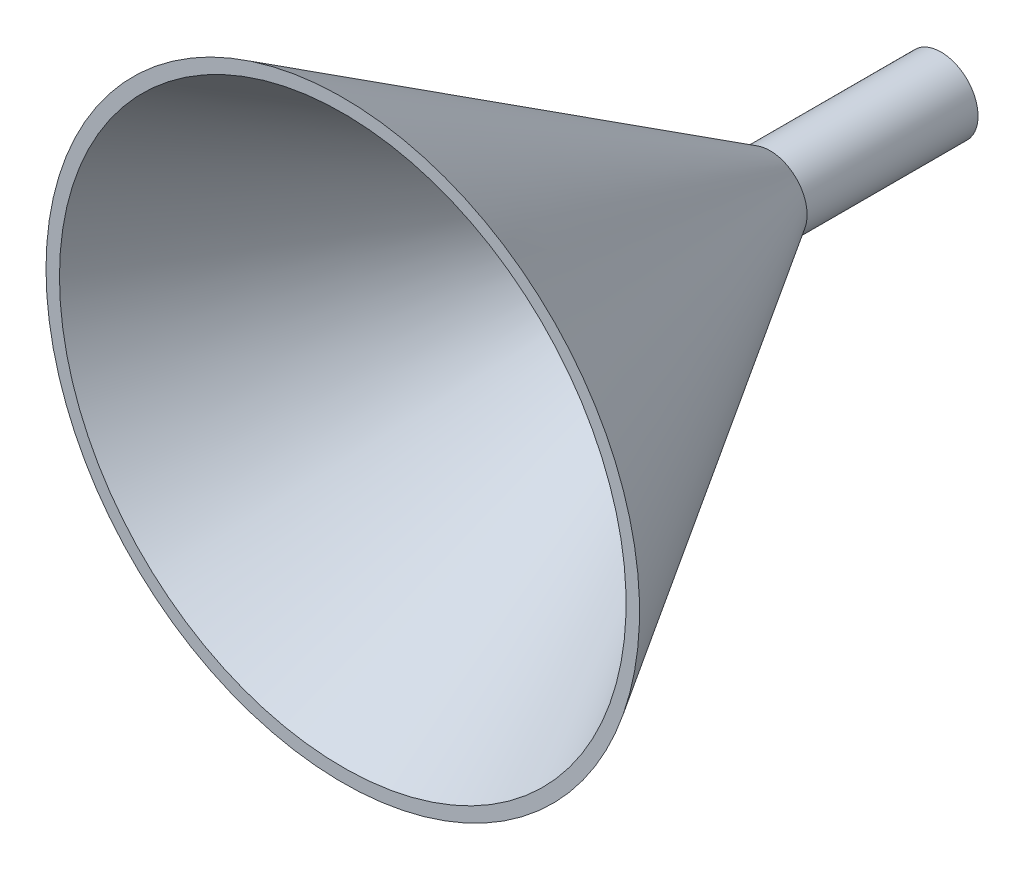
ISO-10303-21;
HEADER;
FILE_DESCRIPTION(('STEP AP214'),'2;1');
FILE_NAME('part.step','',(''),(''),'','','');
FILE_SCHEMA(('AUTOMOTIVE_DESIGN { 1 0 10303 214 1 1 1 1 }'));
ENDSEC;
DATA;
#1=APPLICATION_CONTEXT('core data for automotive mechanical design processes');
#2=APPLICATION_PROTOCOL_DEFINITION('international standard','automotive_design',2000,#1);
#3=PRODUCT_CONTEXT('',#1,'mechanical');
#4=PRODUCT('Part','Part','',(#3));
#5=PRODUCT_RELATED_PRODUCT_CATEGORY('part','',(#4));
#6=PRODUCT_DEFINITION_FORMATION('','',#4);
#7=PRODUCT_DEFINITION_CONTEXT('part definition',#1,'design');
#8=PRODUCT_DEFINITION('design','',#6,#7);
#9=PRODUCT_DEFINITION_SHAPE('','',#8);
#10=(LENGTH_UNIT() NAMED_UNIT(*) SI_UNIT(.MILLI.,.METRE.));
#11=(NAMED_UNIT(*) PLANE_ANGLE_UNIT() SI_UNIT($,.RADIAN.));
#12=(NAMED_UNIT(*) SI_UNIT($,.STERADIAN.) SOLID_ANGLE_UNIT());
#13=UNCERTAINTY_MEASURE_WITH_UNIT(LENGTH_MEASURE(1.E-05),#10,'distance_accuracy_value','');
#14=(GEOMETRIC_REPRESENTATION_CONTEXT(3) GLOBAL_UNCERTAINTY_ASSIGNED_CONTEXT((#13)) GLOBAL_UNIT_ASSIGNED_CONTEXT((#10,
#11,#12)) REPRESENTATION_CONTEXT('',''));
#15=CARTESIAN_POINT('',(0.,0.,0.));
#16=DIRECTION('',(0.,0.,1.));
#17=DIRECTION('',(1.,0.,0.));
#18=AXIS2_PLACEMENT_3D('',#15,#16,#17);
#19=CARTESIAN_POINT('',(0.,0.,0.));
#20=DIRECTION('',(0.,0.,1.));
#21=DIRECTION('',(1.,0.,0.));
#22=AXIS2_PLACEMENT_3D('',#19,#20,#21);
#23=PLANE('',#22);
#24=CARTESIAN_POINT('',(-4.,0.,0.));
#25=DIRECTION('',(0.,0.,-1.));
#26=DIRECTION('',(-1.,0.,0.));
#27=AXIS2_PLACEMENT_3D('',#24,#25,#26);
#28=CIRCLE('',#27,4.);
#29=CARTESIAN_POINT('',(-8.,0.,0.));
#30=VERTEX_POINT('',#29);
#31=EDGE_CURVE('E55',#30,#30,#28,.T.);
#32=ORIENTED_EDGE('',*,*,#31,.F.);
#33=EDGE_LOOP('',(#32));
#34=FACE_BOUND('',#33,.T.);
#35=CARTESIAN_POINT('',(-4.,0.,0.));
#36=DIRECTION('',(0.,0.,-1.));
#37=DIRECTION('',(-1.,0.,0.));
#38=AXIS2_PLACEMENT_3D('',#35,#36,#37);
#39=CIRCLE('',#38,5.5);
#40=CARTESIAN_POINT('',(-9.5,0.,0.));
#41=VERTEX_POINT('',#40);
#42=EDGE_CURVE('E10',#41,#41,#39,.T.);
#43=ORIENTED_EDGE('',*,*,#42,.T.);
#44=EDGE_LOOP('',(#43));
#45=FACE_BOUND('',#44,.T.);
#46=ADVANCED_FACE('F33',(#34,#45),#23,.F.);
#47=CARTESIAN_POINT('',(-4.,0.,0.));
#48=DIRECTION('',(0.,0.,-1.));
#49=DIRECTION('',(-1.,0.,0.));
#50=AXIS2_PLACEMENT_3D('',#47,#48,#49);
#51=CYLINDRICAL_SURFACE('',#50,5.5);
#52=ORIENTED_EDGE('',*,*,#42,.F.);
#53=EDGE_LOOP('',(#52));
#54=FACE_BOUND('',#53,.T.);
#55=CARTESIAN_POINT('',(-4.,0.,25.4));
#56=DIRECTION('',(0.,0.,-1.));
#57=DIRECTION('',(-1.,0.,0.));
#58=AXIS2_PLACEMENT_3D('',#55,#56,#57);
#59=CIRCLE('',#58,5.5);
#60=CARTESIAN_POINT('',(-9.5,0.,25.4));
#61=VERTEX_POINT('',#60);
#62=EDGE_CURVE('E39',#61,#61,#59,.T.);
#63=ORIENTED_EDGE('',*,*,#62,.T.);
#64=EDGE_LOOP('',(#63));
#65=FACE_BOUND('',#64,.T.);
#66=ADVANCED_FACE('F62',(#54,#65),#51,.T.);
#67=CARTESIAN_POINT('',(-3.99999999999999,0.,88.9));
#68=DIRECTION('',(0.,0.,1.));
#69=DIRECTION('',(1.,0.,0.));
#70=AXIS2_PLACEMENT_3D('',#67,#68,#69);
#71=CONICAL_SURFACE('',#70,44.1,0.546189110839705);
#72=ORIENTED_EDGE('',*,*,#62,.F.);
#73=EDGE_LOOP('',(#72));
#74=FACE_BOUND('',#73,.T.);
#75=CARTESIAN_POINT('',(-3.99999999999999,0.,88.9));
#76=DIRECTION('',(0.,0.,-1.));
#77=DIRECTION('',(-1.,0.,0.));
#78=AXIS2_PLACEMENT_3D('',#75,#76,#77);
#79=CIRCLE('',#78,44.1);
#80=CARTESIAN_POINT('',(-48.1,0.,88.9));
#81=VERTEX_POINT('',#80);
#82=EDGE_CURVE('E43',#81,#81,#79,.T.);
#83=ORIENTED_EDGE('',*,*,#82,.T.);
#84=EDGE_LOOP('',(#83));
#85=FACE_BOUND('',#84,.T.);
#86=ADVANCED_FACE('F66',(#74,#85),#71,.T.);
#87=CARTESIAN_POINT('',(40.1,0.,88.9));
#88=DIRECTION('',(0.,0.,-1.));
#89=DIRECTION('',(-1.,0.,0.));
#90=AXIS2_PLACEMENT_3D('',#87,#88,#89);
#91=PLANE('',#90);
#92=ORIENTED_EDGE('',*,*,#82,.F.);
#93=EDGE_LOOP('',(#92));
#94=FACE_BOUND('',#93,.T.);
#95=CARTESIAN_POINT('',(-3.99999999999999,0.,88.9));
#96=DIRECTION('',(0.,0.,-1.));
#97=DIRECTION('',(-1.,0.,0.));
#98=AXIS2_PLACEMENT_3D('',#95,#96,#97);
#99=CIRCLE('',#98,42.1);
#100=CARTESIAN_POINT('',(-46.1,0.,88.9));
#101=VERTEX_POINT('',#100);
#102=EDGE_CURVE('E47',#101,#101,#99,.T.);
#103=ORIENTED_EDGE('',*,*,#102,.T.);
#104=EDGE_LOOP('',(#103));
#105=FACE_BOUND('',#104,.T.);
#106=ADVANCED_FACE('F71',(#94,#105),#91,.F.);
#107=CARTESIAN_POINT('',(-4.,0.,25.4));
#108=DIRECTION('',(0.,0.,1.));
#109=DIRECTION('',(1.,0.,0.));
#110=AXIS2_PLACEMENT_3D('',#107,#108,#109);
#111=CONICAL_SURFACE('',#110,4.,0.540419500270584);
#112=ORIENTED_EDGE('',*,*,#102,.F.);
#113=EDGE_LOOP('',(#112));
#114=FACE_BOUND('',#113,.T.);
#115=CARTESIAN_POINT('',(-4.,0.,25.4));
#116=DIRECTION('',(0.,0.,-1.));
#117=DIRECTION('',(-1.,0.,0.));
#118=AXIS2_PLACEMENT_3D('',#115,#116,#117);
#119=CIRCLE('',#118,4.);
#120=CARTESIAN_POINT('',(-7.99999999999999,0.,25.4));
#121=VERTEX_POINT('',#120);
#122=EDGE_CURVE('E52',#121,#121,#119,.T.);
#123=ORIENTED_EDGE('',*,*,#122,.T.);
#124=EDGE_LOOP('',(#123));
#125=FACE_BOUND('',#124,.T.);
#126=ADVANCED_FACE('F77',(#114,#125),#111,.F.);
#127=CARTESIAN_POINT('',(-4.,0.,0.));
#128=DIRECTION('',(0.,0.,-1.));
#129=DIRECTION('',(-1.,0.,0.));
#130=AXIS2_PLACEMENT_3D('',#127,#128,#129);
#131=CYLINDRICAL_SURFACE('',#130,4.);
#132=ORIENTED_EDGE('',*,*,#122,.F.);
#133=EDGE_LOOP('',(#132));
#134=FACE_BOUND('',#133,.T.);
#135=ORIENTED_EDGE('',*,*,#31,.T.);
#136=EDGE_LOOP('',(#135));
#137=FACE_BOUND('',#136,.T.);
#138=ADVANCED_FACE('F59',(#134,#137),#131,.F.);
#139=CLOSED_SHELL('',(#46,#66,#86,#106,#126,#138));
#140=MANIFOLD_SOLID_BREP('B2',#139);
#141=ADVANCED_BREP_SHAPE_REPRESENTATION('',(#18,#140),#14);
#142=SHAPE_DEFINITION_REPRESENTATION(#9,#141);
ENDSEC;
END-ISO-10303-21;
